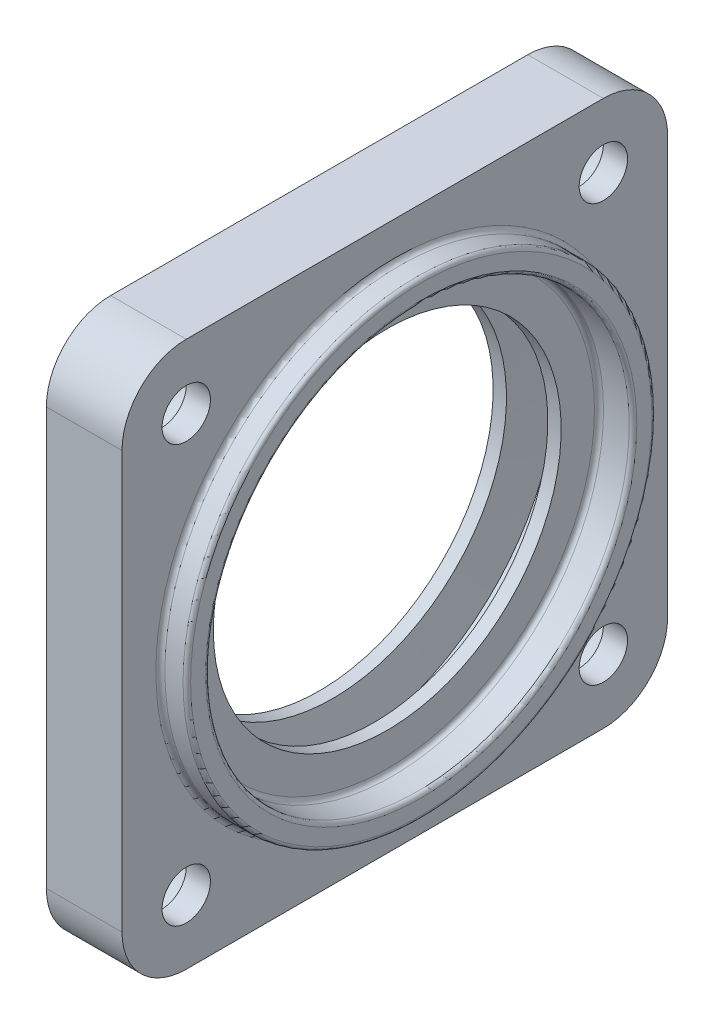
ISO-10303-21;
HEADER;
FILE_DESCRIPTION(('STEP AP214'),'2;1');
FILE_NAME('part.step','',(''),(''),'','','');
FILE_SCHEMA(('AUTOMOTIVE_DESIGN { 1 0 10303 214 1 1 1 1 }'));
ENDSEC;
DATA;
#1=APPLICATION_CONTEXT('core data for automotive mechanical design processes');
#2=APPLICATION_PROTOCOL_DEFINITION('international standard','automotive_design',2000,#1);
#3=PRODUCT_CONTEXT('',#1,'mechanical');
#4=PRODUCT('Part','Part','',(#3));
#5=PRODUCT_RELATED_PRODUCT_CATEGORY('part','',(#4));
#6=PRODUCT_DEFINITION_FORMATION('','',#4);
#7=PRODUCT_DEFINITION_CONTEXT('part definition',#1,'design');
#8=PRODUCT_DEFINITION('design','',#6,#7);
#9=PRODUCT_DEFINITION_SHAPE('','',#8);
#10=(LENGTH_UNIT() NAMED_UNIT(*) SI_UNIT(.MILLI.,.METRE.));
#11=(NAMED_UNIT(*) PLANE_ANGLE_UNIT() SI_UNIT($,.RADIAN.));
#12=(NAMED_UNIT(*) SI_UNIT($,.STERADIAN.) SOLID_ANGLE_UNIT());
#13=UNCERTAINTY_MEASURE_WITH_UNIT(LENGTH_MEASURE(1.E-05),#10,'distance_accuracy_value','');
#14=(GEOMETRIC_REPRESENTATION_CONTEXT(3) GLOBAL_UNCERTAINTY_ASSIGNED_CONTEXT((#13)) GLOBAL_UNIT_ASSIGNED_CONTEXT((#10,
#11,#12)) REPRESENTATION_CONTEXT('',''));
#15=CARTESIAN_POINT('',(0.,0.,0.));
#16=DIRECTION('',(0.,0.,1.));
#17=DIRECTION('',(1.,0.,0.));
#18=AXIS2_PLACEMENT_3D('',#15,#16,#17);
#19=CARTESIAN_POINT('',(0.,0.,0.));
#20=DIRECTION('',(-1.,0.,0.));
#21=DIRECTION('',(0.,0.,1.));
#22=AXIS2_PLACEMENT_3D('',#19,#20,#21);
#23=CYLINDRICAL_SURFACE('',#22,28.);
#24=CARTESIAN_POINT('',(5.09999999999999,0.,0.));
#25=DIRECTION('',(-1.,0.,0.));
#26=DIRECTION('',(0.,0.,1.));
#27=AXIS2_PLACEMENT_3D('',#24,#25,#26);
#28=CIRCLE('',#27,28.);
#29=CARTESIAN_POINT('',(5.09999999999999,0.,28.0000000000001));
#30=VERTEX_POINT('',#29);
#31=EDGE_CURVE('E45',#30,#30,#28,.T.);
#32=ORIENTED_EDGE('',*,*,#31,.T.);
#33=EDGE_LOOP('',(#32));
#34=FACE_BOUND('',#33,.T.);
#35=CARTESIAN_POINT('',(8.50000000000001,0.,0.));
#36=DIRECTION('',(1.,0.,0.));
#37=DIRECTION('',(0.,0.,-1.));
#38=AXIS2_PLACEMENT_3D('',#35,#36,#37);
#39=CIRCLE('',#38,28.);
#40=CARTESIAN_POINT('',(8.50000000000001,0.,-28.0000000000001));
#41=VERTEX_POINT('',#40);
#42=EDGE_CURVE('E268',#41,#41,#39,.T.);
#43=ORIENTED_EDGE('',*,*,#42,.T.);
#44=EDGE_LOOP('',(#43));
#45=FACE_BOUND('',#44,.T.);
#46=ADVANCED_FACE('F37',(#34,#45),#23,.F.);
#47=CARTESIAN_POINT('',(0.,0.,0.));
#48=DIRECTION('',(-1.,0.,0.));
#49=DIRECTION('',(0.,0.,1.));
#50=AXIS2_PLACEMENT_3D('',#47,#48,#49);
#51=CYLINDRICAL_SURFACE('',#50,31.);
#52=CARTESIAN_POINT('',(8.50000000000001,0.,0.));
#53=DIRECTION('',(1.,0.,0.));
#54=DIRECTION('',(0.,0.,-1.));
#55=AXIS2_PLACEMENT_3D('',#52,#53,#54);
#56=CIRCLE('',#55,31.);
#57=CARTESIAN_POINT('',(8.50000000000001,0.,-31.0000000000002));
#58=VERTEX_POINT('',#57);
#59=EDGE_CURVE('E271',#58,#58,#56,.F.);
#60=ORIENTED_EDGE('',*,*,#59,.T.);
#61=EDGE_LOOP('',(#60));
#62=FACE_BOUND('',#61,.T.);
#63=CARTESIAN_POINT('',(6.09999999999999,0.,0.));
#64=DIRECTION('',(-1.,0.,0.));
#65=DIRECTION('',(0.,0.,1.));
#66=AXIS2_PLACEMENT_3D('',#63,#64,#65);
#67=CIRCLE('',#66,31.);
#68=CARTESIAN_POINT('',(6.09999999999999,0.,31.0000000000002));
#69=VERTEX_POINT('',#68);
#70=EDGE_CURVE('E258',#69,#69,#67,.F.);
#71=ORIENTED_EDGE('',*,*,#70,.T.);
#72=EDGE_LOOP('',(#71));
#73=FACE_BOUND('',#72,.T.);
#74=ADVANCED_FACE('F288',(#62,#73),#51,.T.);
#75=CARTESIAN_POINT('',(-4.5,47.5000000000003,0.));
#76=DIRECTION('',(1.,0.,0.));
#77=DIRECTION('',(0.,0.,-1.));
#78=AXIS2_PLACEMENT_3D('',#75,#76,#77);
#79=PLANE('',#78);
#80=CARTESIAN_POINT('',(-4.5,27.5771644662755,-27.5771644662755));
#81=DIRECTION('',(-1.,0.,0.));
#82=DIRECTION('',(0.,0.,1.));
#83=AXIS2_PLACEMENT_3D('',#80,#81,#82);
#84=CIRCLE('',#83,5.49999999999999);
#85=CARTESIAN_POINT('',(-4.5,27.5771644662755,-22.0771644662755));
#86=VERTEX_POINT('',#85);
#87=EDGE_CURVE('E163',#86,#86,#84,.T.);
#88=ORIENTED_EDGE('',*,*,#87,.F.);
#89=EDGE_LOOP('',(#88));
#90=FACE_BOUND('',#89,.T.);
#91=CARTESIAN_POINT('',(-4.5,27.5771644662755,27.5771644662755));
#92=DIRECTION('',(-1.,0.,0.));
#93=DIRECTION('',(0.,0.,1.));
#94=AXIS2_PLACEMENT_3D('',#91,#92,#93);
#95=CIRCLE('',#94,5.49999999999999);
#96=CARTESIAN_POINT('',(-4.5,27.5771644662755,33.0771644662755));
#97=VERTEX_POINT('',#96);
#98=EDGE_CURVE('E175',#97,#97,#95,.T.);
#99=ORIENTED_EDGE('',*,*,#98,.F.);
#100=EDGE_LOOP('',(#99));
#101=FACE_BOUND('',#100,.T.);
#102=CARTESIAN_POINT('',(-4.5,-27.5771644662755,27.5771644662755));
#103=DIRECTION('',(-1.,0.,0.));
#104=DIRECTION('',(0.,0.,1.));
#105=AXIS2_PLACEMENT_3D('',#102,#103,#104);
#106=CIRCLE('',#105,5.49999999999999);
#107=CARTESIAN_POINT('',(-4.5,-27.5771644662755,33.0771644662755));
#108=VERTEX_POINT('',#107);
#109=EDGE_CURVE('E188',#108,#108,#106,.T.);
#110=ORIENTED_EDGE('',*,*,#109,.F.);
#111=EDGE_LOOP('',(#110));
#112=FACE_BOUND('',#111,.T.);
#113=CARTESIAN_POINT('',(-4.5,-27.5771644662755,-27.5771644662755));
#114=DIRECTION('',(-1.,0.,0.));
#115=DIRECTION('',(0.,0.,1.));
#116=AXIS2_PLACEMENT_3D('',#113,#114,#115);
#117=CIRCLE('',#116,5.49999999999999);
#118=CARTESIAN_POINT('',(-4.5,-27.5771644662755,-22.0771644662755));
#119=VERTEX_POINT('',#118);
#120=EDGE_CURVE('E201',#119,#119,#117,.T.);
#121=ORIENTED_EDGE('',*,*,#120,.F.);
#122=EDGE_LOOP('',(#121));
#123=FACE_BOUND('',#122,.T.);
#124=CARTESIAN_POINT('',(-4.5,0.,0.));
#125=DIRECTION('',(-1.,0.,0.));
#126=DIRECTION('',(0.,0.,1.));
#127=AXIS2_PLACEMENT_3D('',#124,#125,#126);
#128=CIRCLE('',#127,23.);
#129=CARTESIAN_POINT('',(-4.5,0.,23.0000000000001));
#130=VERTEX_POINT('',#129);
#131=EDGE_CURVE('E232',#130,#130,#128,.T.);
#132=ORIENTED_EDGE('',*,*,#131,.F.);
#133=EDGE_LOOP('',(#132));
#134=FACE_BOUND('',#133,.T.);
#135=CARTESIAN_POINT('',(-4.5,27.5771644662755,-27.5771644662755));
#136=DIRECTION('',(-1.,0.,0.));
#137=DIRECTION('',(0.,0.,1.));
#138=AXIS2_PLACEMENT_3D('',#135,#136,#137);
#139=CIRCLE('',#138,8.5);
#140=CARTESIAN_POINT('',(-4.5,36.0771644662755,-27.5771644662755));
#141=VERTEX_POINT('',#140);
#142=CARTESIAN_POINT('',(-4.5,27.5771644662757,-36.0771644662755));
#143=VERTEX_POINT('',#142);
#144=EDGE_CURVE('E443',#141,#143,#139,.T.);
#145=ORIENTED_EDGE('',*,*,#144,.T.);
#146=DIRECTION('',(0.,-1.,0.));
#147=VECTOR('',#146,1.);
#148=CARTESIAN_POINT('',(-4.5,27.5771644662757,-36.0771644662755));
#149=LINE('',#148,#147);
#150=CARTESIAN_POINT('',(-4.5,-27.5771644662755,-36.0771644662755));
#151=VERTEX_POINT('',#150);
#152=EDGE_CURVE('E109',#143,#151,#149,.T.);
#153=ORIENTED_EDGE('',*,*,#152,.T.);
#154=CARTESIAN_POINT('',(-4.5,-27.5771644662755,-27.5771644662755));
#155=DIRECTION('',(-1.,0.,0.));
#156=DIRECTION('',(0.,0.,1.));
#157=AXIS2_PLACEMENT_3D('',#154,#155,#156);
#158=CIRCLE('',#157,8.5);
#159=CARTESIAN_POINT('',(-4.5,-36.0771644662755,-27.5771644662755));
#160=VERTEX_POINT('',#159);
#161=EDGE_CURVE('E52',#151,#160,#158,.T.);
#162=ORIENTED_EDGE('',*,*,#161,.T.);
#163=DIRECTION('',(0.,0.,1.));
#164=VECTOR('',#163,1.);
#165=CARTESIAN_POINT('',(-4.5,-36.0771644662755,-27.5771644662755));
#166=LINE('',#165,#164);
#167=CARTESIAN_POINT('',(-4.5,-36.0771644662755,27.5771644662755));
#168=VERTEX_POINT('',#167);
#169=EDGE_CURVE('E107',#160,#168,#166,.T.);
#170=ORIENTED_EDGE('',*,*,#169,.T.);
#171=CARTESIAN_POINT('',(-4.5,-27.5771644662755,27.5771644662755));
#172=DIRECTION('',(-1.,0.,0.));
#173=DIRECTION('',(0.,0.,1.));
#174=AXIS2_PLACEMENT_3D('',#171,#172,#173);
#175=CIRCLE('',#174,8.5);
#176=CARTESIAN_POINT('',(-4.5,-27.5771644662755,36.0771644662755));
#177=VERTEX_POINT('',#176);
#178=EDGE_CURVE('E125',#168,#177,#175,.T.);
#179=ORIENTED_EDGE('',*,*,#178,.T.);
#180=DIRECTION('',(0.,1.,0.));
#181=VECTOR('',#180,1.);
#182=CARTESIAN_POINT('',(-4.5,-27.5771644662755,36.0771644662755));
#183=LINE('',#182,#181);
#184=CARTESIAN_POINT('',(-4.5,27.5771644662755,36.0771644662755));
#185=VERTEX_POINT('',#184);
#186=EDGE_CURVE('E130',#177,#185,#183,.T.);
#187=ORIENTED_EDGE('',*,*,#186,.T.);
#188=CARTESIAN_POINT('',(-4.5,27.5771644662755,27.5771644662755));
#189=DIRECTION('',(-1.,0.,0.));
#190=DIRECTION('',(0.,0.,1.));
#191=AXIS2_PLACEMENT_3D('',#188,#189,#190);
#192=CIRCLE('',#191,8.5);
#193=CARTESIAN_POINT('',(-4.5,36.0771644662755,27.5771644662755));
#194=VERTEX_POINT('',#193);
#195=EDGE_CURVE('E137',#185,#194,#192,.T.);
#196=ORIENTED_EDGE('',*,*,#195,.T.);
#197=DIRECTION('',(0.,0.,-1.));
#198=VECTOR('',#197,1.);
#199=CARTESIAN_POINT('',(-4.5,36.0771644662755,27.5771644662755));
#200=LINE('',#199,#198);
#201=EDGE_CURVE('E139',#194,#141,#200,.T.);
#202=ORIENTED_EDGE('',*,*,#201,.T.);
#203=EDGE_LOOP('',(#145,#153,#162,#170,#179,#187,#196,#202));
#204=FACE_BOUND('',#203,.T.);
#205=ADVANCED_FACE('F105',(#90,#101,#112,#123,#134,#204),#79,.F.);
#206=CARTESIAN_POINT('',(5.50000000000001,31.0000000000002,0.));
#207=DIRECTION('',(-1.,0.,0.));
#208=DIRECTION('',(0.,0.,1.));
#209=AXIS2_PLACEMENT_3D('',#206,#207,#208);
#210=PLANE('',#209);
#211=CARTESIAN_POINT('',(5.50000000000001,0.,0.));
#212=DIRECTION('',(-1.,0.,0.));
#213=DIRECTION('',(0.,0.,1.));
#214=AXIS2_PLACEMENT_3D('',#211,#212,#213);
#215=CIRCLE('',#214,31.6);
#216=CARTESIAN_POINT('',(5.50000000000001,0.,31.6000000000002));
#217=VERTEX_POINT('',#216);
#218=EDGE_CURVE('E254',#217,#217,#215,.T.);
#219=ORIENTED_EDGE('',*,*,#218,.T.);
#220=EDGE_LOOP('',(#219));
#221=FACE_BOUND('',#220,.T.);
#222=CARTESIAN_POINT('',(5.50000000000001,27.5771644662755,-27.5771644662755));
#223=DIRECTION('',(-1.,0.,0.));
#224=DIRECTION('',(0.,0.,1.));
#225=AXIS2_PLACEMENT_3D('',#222,#223,#224);
#226=CIRCLE('',#225,3.2);
#227=CARTESIAN_POINT('',(5.50000000000001,27.5771644662755,-24.3771644662755));
#228=VERTEX_POINT('',#227);
#229=EDGE_CURVE('E174',#228,#228,#226,.T.);
#230=ORIENTED_EDGE('',*,*,#229,.T.);
#231=EDGE_LOOP('',(#230));
#232=FACE_BOUND('',#231,.T.);
#233=CARTESIAN_POINT('',(5.50000000000001,27.5771644662755,27.5771644662755));
#234=DIRECTION('',(-1.,0.,0.));
#235=DIRECTION('',(0.,0.,1.));
#236=AXIS2_PLACEMENT_3D('',#233,#234,#235);
#237=CIRCLE('',#236,3.2);
#238=CARTESIAN_POINT('',(5.50000000000001,27.5771644662755,30.7771644662755));
#239=VERTEX_POINT('',#238);
#240=EDGE_CURVE('E187',#239,#239,#237,.T.);
#241=ORIENTED_EDGE('',*,*,#240,.T.);
#242=EDGE_LOOP('',(#241));
#243=FACE_BOUND('',#242,.T.);
#244=CARTESIAN_POINT('',(5.50000000000001,-27.5771644662755,27.5771644662755));
#245=DIRECTION('',(-1.,0.,0.));
#246=DIRECTION('',(0.,0.,1.));
#247=AXIS2_PLACEMENT_3D('',#244,#245,#246);
#248=CIRCLE('',#247,3.2);
#249=CARTESIAN_POINT('',(5.50000000000001,-27.5771644662755,30.7771644662755));
#250=VERTEX_POINT('',#249);
#251=EDGE_CURVE('E200',#250,#250,#248,.T.);
#252=ORIENTED_EDGE('',*,*,#251,.T.);
#253=EDGE_LOOP('',(#252));
#254=FACE_BOUND('',#253,.T.);
#255=CARTESIAN_POINT('',(5.50000000000001,-27.5771644662755,-27.5771644662755));
#256=DIRECTION('',(-1.,0.,0.));
#257=DIRECTION('',(0.,0.,1.));
#258=AXIS2_PLACEMENT_3D('',#255,#256,#257);
#259=CIRCLE('',#258,3.2);
#260=CARTESIAN_POINT('',(5.50000000000001,-27.5771644662755,-24.3771644662755));
#261=VERTEX_POINT('',#260);
#262=EDGE_CURVE('E213',#261,#261,#259,.T.);
#263=ORIENTED_EDGE('',*,*,#262,.T.);
#264=EDGE_LOOP('',(#263));
#265=FACE_BOUND('',#264,.T.);
#266=CARTESIAN_POINT('',(5.50000000000001,27.5771644662755,27.5771644662755));
#267=DIRECTION('',(-1.,0.,0.));
#268=DIRECTION('',(0.,0.,1.));
#269=AXIS2_PLACEMENT_3D('',#266,#267,#268);
#270=CIRCLE('',#269,8.5);
#271=CARTESIAN_POINT('',(5.50000000000001,27.5771644662755,36.0771644662755));
#272=VERTEX_POINT('',#271);
#273=CARTESIAN_POINT('',(5.50000000000001,36.0771644662755,27.5771644662755));
#274=VERTEX_POINT('',#273);
#275=EDGE_CURVE('E159',#272,#274,#270,.T.);
#276=ORIENTED_EDGE('',*,*,#275,.F.);
#277=DIRECTION('',(0.,1.,0.));
#278=VECTOR('',#277,1.);
#279=CARTESIAN_POINT('',(5.50000000000001,31.0000000000002,36.0771644662755));
#280=LINE('',#279,#278);
#281=CARTESIAN_POINT('',(5.50000000000001,-27.5771644662755,36.0771644662755));
#282=VERTEX_POINT('',#281);
#283=EDGE_CURVE('E251',#282,#272,#280,.T.);
#284=ORIENTED_EDGE('',*,*,#283,.F.);
#285=CARTESIAN_POINT('',(5.50000000000001,-27.5771644662755,27.5771644662755));
#286=DIRECTION('',(-1.,0.,0.));
#287=DIRECTION('',(0.,0.,1.));
#288=AXIS2_PLACEMENT_3D('',#285,#286,#287);
#289=CIRCLE('',#288,8.5);
#290=CARTESIAN_POINT('',(5.50000000000001,-36.0771644662755,27.5771644662755));
#291=VERTEX_POINT('',#290);
#292=EDGE_CURVE('E157',#291,#282,#289,.T.);
#293=ORIENTED_EDGE('',*,*,#292,.F.);
#294=DIRECTION('',(0.,0.,1.));
#295=VECTOR('',#294,1.);
#296=CARTESIAN_POINT('',(5.50000000000001,-36.0771644662755,0.));
#297=LINE('',#296,#295);
#298=CARTESIAN_POINT('',(5.50000000000001,-36.0771644662755,-27.5771644662755));
#299=VERTEX_POINT('',#298);
#300=EDGE_CURVE('E247',#299,#291,#297,.T.);
#301=ORIENTED_EDGE('',*,*,#300,.F.);
#302=CARTESIAN_POINT('',(5.50000000000001,-27.5771644662755,-27.5771644662755));
#303=DIRECTION('',(-1.,0.,0.));
#304=DIRECTION('',(0.,0.,1.));
#305=AXIS2_PLACEMENT_3D('',#302,#303,#304);
#306=CIRCLE('',#305,8.5);
#307=CARTESIAN_POINT('',(5.50000000000001,-27.5771644662755,-36.0771644662755));
#308=VERTEX_POINT('',#307);
#309=EDGE_CURVE('E115',#308,#299,#306,.T.);
#310=ORIENTED_EDGE('',*,*,#309,.F.);
#311=DIRECTION('',(0.,-1.,0.));
#312=VECTOR('',#311,1.);
#313=CARTESIAN_POINT('',(5.50000000000001,31.0000000000003,-36.0771644662755));
#314=LINE('',#313,#312);
#315=CARTESIAN_POINT('',(5.50000000000001,27.5771644662757,-36.0771644662755));
#316=VERTEX_POINT('',#315);
#317=EDGE_CURVE('E236',#316,#308,#314,.T.);
#318=ORIENTED_EDGE('',*,*,#317,.F.);
#319=CARTESIAN_POINT('',(5.50000000000001,27.5771644662755,-27.5771644662755));
#320=DIRECTION('',(-1.,0.,0.));
#321=DIRECTION('',(0.,0.,1.));
#322=AXIS2_PLACEMENT_3D('',#319,#320,#321);
#323=CIRCLE('',#322,8.5);
#324=CARTESIAN_POINT('',(5.50000000000001,36.0771644662755,-27.5771644662755));
#325=VERTEX_POINT('',#324);
#326=EDGE_CURVE('E60',#325,#316,#323,.T.);
#327=ORIENTED_EDGE('',*,*,#326,.F.);
#328=DIRECTION('',(0.,0.,-1.));
#329=VECTOR('',#328,1.);
#330=CARTESIAN_POINT('',(5.50000000000001,36.0771644662755,0.));
#331=LINE('',#330,#329);
#332=EDGE_CURVE('E249',#274,#325,#331,.T.);
#333=ORIENTED_EDGE('',*,*,#332,.F.);
#334=EDGE_LOOP('',(#276,#284,#293,#301,#310,#318,#327,#333));
#335=FACE_BOUND('',#334,.T.);
#336=ADVANCED_FACE('F321',(#221,#232,#243,#254,#265,#335),#210,.F.);
#337=CARTESIAN_POINT('',(0.,0.,0.));
#338=DIRECTION('',(-1.,0.,0.));
#339=DIRECTION('',(0.,0.,1.));
#340=AXIS2_PLACEMENT_3D('',#337,#338,#339);
#341=CYLINDRICAL_SURFACE('',#340,23.);
#342=CARTESIAN_POINT('',(-2.7367073654174,0.,0.));
#343=DIRECTION('',(-1.,0.,0.));
#344=DIRECTION('',(0.,0.,1.));
#345=AXIS2_PLACEMENT_3D('',#342,#343,#344);
#346=CIRCLE('',#345,23.);
#347=CARTESIAN_POINT('',(-2.7367073654174,0.,23.0000000000001));
#348=VERTEX_POINT('',#347);
#349=EDGE_CURVE('E228',#348,#348,#346,.T.);
#350=ORIENTED_EDGE('',*,*,#349,.F.);
#351=EDGE_LOOP('',(#350));
#352=FACE_BOUND('',#351,.T.);
#353=ORIENTED_EDGE('',*,*,#131,.T.);
#354=EDGE_LOOP('',(#353));
#355=FACE_BOUND('',#354,.T.);
#356=ADVANCED_FACE('F317',(#352,#355),#341,.F.);
#357=CARTESIAN_POINT('',(-2.7367073654174,0.,0.));
#358=DIRECTION('',(1.,0.,0.));
#359=DIRECTION('',(0.,0.,-1.));
#360=AXIS2_PLACEMENT_3D('',#357,#358,#359);
#361=CONICAL_SURFACE('',#360,23.,1.4486232791553);
#362=CARTESIAN_POINT('',(-2.,0.,0.));
#363=DIRECTION('',(-1.,0.,0.));
#364=DIRECTION('',(0.,0.,1.));
#365=AXIS2_PLACEMENT_3D('',#362,#363,#364);
#366=CIRCLE('',#365,29.);
#367=CARTESIAN_POINT('',(-2.,0.,29.0000000000001));
#368=VERTEX_POINT('',#367);
#369=EDGE_CURVE('E224',#368,#368,#366,.T.);
#370=ORIENTED_EDGE('',*,*,#369,.F.);
#371=EDGE_LOOP('',(#370));
#372=FACE_BOUND('',#371,.T.);
#373=ORIENTED_EDGE('',*,*,#349,.T.);
#374=EDGE_LOOP('',(#373));
#375=FACE_BOUND('',#374,.T.);
#376=ADVANCED_FACE('F313',(#372,#375),#361,.F.);
#377=CARTESIAN_POINT('',(0.,0.,0.));
#378=DIRECTION('',(-1.,0.,0.));
#379=DIRECTION('',(0.,0.,1.));
#380=AXIS2_PLACEMENT_3D('',#377,#378,#379);
#381=CYLINDRICAL_SURFACE('',#380,29.);
#382=CARTESIAN_POINT('',(2.,0.,0.));
#383=DIRECTION('',(-1.,0.,0.));
#384=DIRECTION('',(0.,0.,1.));
#385=AXIS2_PLACEMENT_3D('',#382,#383,#384);
#386=CIRCLE('',#385,29.);
#387=CARTESIAN_POINT('',(2.,0.,29.0000000000001));
#388=VERTEX_POINT('',#387);
#389=EDGE_CURVE('E220',#388,#388,#386,.T.);
#390=ORIENTED_EDGE('',*,*,#389,.F.);
#391=EDGE_LOOP('',(#390));
#392=FACE_BOUND('',#391,.T.);
#393=ORIENTED_EDGE('',*,*,#369,.T.);
#394=EDGE_LOOP('',(#393));
#395=FACE_BOUND('',#394,.T.);
#396=ADVANCED_FACE('F309',(#392,#395),#381,.F.);
#397=CARTESIAN_POINT('',(2.,0.,0.));
#398=DIRECTION('',(-1.,0.,0.));
#399=DIRECTION('',(0.,0.,1.));
#400=AXIS2_PLACEMENT_3D('',#397,#398,#399);
#401=CONICAL_SURFACE('',#400,29.,1.4486232791553);
#402=CARTESIAN_POINT('',(2.7367073654174,0.,0.));
#403=DIRECTION('',(-1.,0.,0.));
#404=DIRECTION('',(0.,0.,1.));
#405=AXIS2_PLACEMENT_3D('',#402,#403,#404);
#406=CIRCLE('',#405,23.);
#407=CARTESIAN_POINT('',(2.7367073654174,0.,23.0000000000001));
#408=VERTEX_POINT('',#407);
#409=EDGE_CURVE('E217',#408,#408,#406,.T.);
#410=ORIENTED_EDGE('',*,*,#409,.F.);
#411=EDGE_LOOP('',(#410));
#412=FACE_BOUND('',#411,.T.);
#413=ORIENTED_EDGE('',*,*,#389,.T.);
#414=EDGE_LOOP('',(#413));
#415=FACE_BOUND('',#414,.T.);
#416=ADVANCED_FACE('F305',(#412,#415),#401,.F.);
#417=CARTESIAN_POINT('',(0.,0.,0.));
#418=DIRECTION('',(-1.,0.,0.));
#419=DIRECTION('',(0.,0.,1.));
#420=AXIS2_PLACEMENT_3D('',#417,#418,#419);
#421=CYLINDRICAL_SURFACE('',#420,23.);
#422=CARTESIAN_POINT('',(4.5,0.,0.));
#423=DIRECTION('',(-1.,0.,0.));
#424=DIRECTION('',(0.,0.,1.));
#425=AXIS2_PLACEMENT_3D('',#422,#423,#424);
#426=CIRCLE('',#425,23.);
#427=CARTESIAN_POINT('',(4.5,0.,23.0000000000001));
#428=VERTEX_POINT('',#427);
#429=EDGE_CURVE('E214',#428,#428,#426,.T.);
#430=ORIENTED_EDGE('',*,*,#429,.F.);
#431=EDGE_LOOP('',(#430));
#432=FACE_BOUND('',#431,.T.);
#433=ORIENTED_EDGE('',*,*,#409,.T.);
#434=EDGE_LOOP('',(#433));
#435=FACE_BOUND('',#434,.T.);
#436=ADVANCED_FACE('F301',(#432,#435),#421,.F.);
#437=CARTESIAN_POINT('',(4.5,23.0000000000002,0.));
#438=DIRECTION('',(-1.,0.,0.));
#439=DIRECTION('',(0.,0.,1.));
#440=AXIS2_PLACEMENT_3D('',#437,#438,#439);
#441=PLANE('',#440);
#442=CARTESIAN_POINT('',(4.5,0.,0.));
#443=DIRECTION('',(-1.,0.,0.));
#444=DIRECTION('',(0.,0.,1.));
#445=AXIS2_PLACEMENT_3D('',#442,#443,#444);
#446=CIRCLE('',#445,27.4);
#447=CARTESIAN_POINT('',(4.5,0.,27.4000000000001));
#448=VERTEX_POINT('',#447);
#449=EDGE_CURVE('E12',#448,#448,#446,.F.);
#450=ORIENTED_EDGE('',*,*,#449,.T.);
#451=EDGE_LOOP('',(#450));
#452=FACE_BOUND('',#451,.T.);
#453=ORIENTED_EDGE('',*,*,#429,.T.);
#454=EDGE_LOOP('',(#453));
#455=FACE_BOUND('',#454,.T.);
#456=ADVANCED_FACE('F297',(#452,#455),#441,.F.);
#457=CARTESIAN_POINT('',(-4.5,-27.5771644662755,-27.5771644662755));
#458=DIRECTION('',(-1.,0.,0.));
#459=DIRECTION('',(0.,0.,1.));
#460=AXIS2_PLACEMENT_3D('',#457,#458,#459);
#461=CYLINDRICAL_SURFACE('',#460,3.2);
#462=CARTESIAN_POINT('',(2.3,-27.5771644662755,-27.5771644662755));
#463=DIRECTION('',(-1.,0.,0.));
#464=DIRECTION('',(0.,0.,1.));
#465=AXIS2_PLACEMENT_3D('',#462,#463,#464);
#466=CIRCLE('',#465,3.2);
#467=CARTESIAN_POINT('',(2.3,-27.5771644662755,-24.3771644662755));
#468=VERTEX_POINT('',#467);
#469=EDGE_CURVE('E209',#468,#468,#466,.T.);
#470=ORIENTED_EDGE('',*,*,#469,.T.);
#471=EDGE_LOOP('',(#470));
#472=FACE_BOUND('',#471,.T.);
#473=ORIENTED_EDGE('',*,*,#262,.F.);
#474=EDGE_LOOP('',(#473));
#475=FACE_BOUND('',#474,.T.);
#476=ADVANCED_FACE('F300',(#472,#475),#461,.F.);
#477=CARTESIAN_POINT('',(2.3,-24.3771644662755,-27.5771644662755));
#478=DIRECTION('',(1.,0.,0.));
#479=DIRECTION('',(0.,0.,-1.));
#480=AXIS2_PLACEMENT_3D('',#477,#478,#479);
#481=PLANE('',#480);
#482=ORIENTED_EDGE('',*,*,#469,.F.);
#483=EDGE_LOOP('',(#482));
#484=FACE_BOUND('',#483,.T.);
#485=CARTESIAN_POINT('',(2.3,-27.5771644662755,-27.5771644662755));
#486=DIRECTION('',(-1.,0.,0.));
#487=DIRECTION('',(0.,0.,1.));
#488=AXIS2_PLACEMENT_3D('',#485,#486,#487);
#489=CIRCLE('',#488,5.5);
#490=CARTESIAN_POINT('',(2.3,-27.5771644662755,-22.0771644662755));
#491=VERTEX_POINT('',#490);
#492=EDGE_CURVE('E205',#491,#491,#489,.T.);
#493=ORIENTED_EDGE('',*,*,#492,.T.);
#494=EDGE_LOOP('',(#493));
#495=FACE_BOUND('',#494,.T.);
#496=ADVANCED_FACE('F413',(#484,#495),#481,.F.);
#497=CARTESIAN_POINT('',(-4.5,-27.5771644662755,-27.5771644662755));
#498=DIRECTION('',(-1.,0.,0.));
#499=DIRECTION('',(0.,0.,1.));
#500=AXIS2_PLACEMENT_3D('',#497,#498,#499);
#501=CYLINDRICAL_SURFACE('',#500,5.5);
#502=ORIENTED_EDGE('',*,*,#492,.F.);
#503=EDGE_LOOP('',(#502));
#504=FACE_BOUND('',#503,.T.);
#505=ORIENTED_EDGE('',*,*,#120,.T.);
#506=EDGE_LOOP('',(#505));
#507=FACE_BOUND('',#506,.T.);
#508=ADVANCED_FACE('F409',(#504,#507),#501,.F.);
#509=CARTESIAN_POINT('',(-4.5,-27.5771644662755,27.5771644662755));
#510=DIRECTION('',(-1.,0.,0.));
#511=DIRECTION('',(0.,0.,1.));
#512=AXIS2_PLACEMENT_3D('',#509,#510,#511);
#513=CYLINDRICAL_SURFACE('',#512,3.2);
#514=CARTESIAN_POINT('',(2.3,-27.5771644662755,27.5771644662755));
#515=DIRECTION('',(-1.,0.,0.));
#516=DIRECTION('',(0.,0.,1.));
#517=AXIS2_PLACEMENT_3D('',#514,#515,#516);
#518=CIRCLE('',#517,3.2);
#519=CARTESIAN_POINT('',(2.3,-27.5771644662755,30.7771644662755));
#520=VERTEX_POINT('',#519);
#521=EDGE_CURVE('E196',#520,#520,#518,.T.);
#522=ORIENTED_EDGE('',*,*,#521,.T.);
#523=EDGE_LOOP('',(#522));
#524=FACE_BOUND('',#523,.T.);
#525=ORIENTED_EDGE('',*,*,#251,.F.);
#526=EDGE_LOOP('',(#525));
#527=FACE_BOUND('',#526,.T.);
#528=ADVANCED_FACE('F405',(#524,#527),#513,.F.);
#529=CARTESIAN_POINT('',(2.3,-24.3771644662755,27.5771644662755));
#530=DIRECTION('',(1.,0.,0.));
#531=DIRECTION('',(0.,0.,-1.));
#532=AXIS2_PLACEMENT_3D('',#529,#530,#531);
#533=PLANE('',#532);
#534=ORIENTED_EDGE('',*,*,#521,.F.);
#535=EDGE_LOOP('',(#534));
#536=FACE_BOUND('',#535,.T.);
#537=CARTESIAN_POINT('',(2.3,-27.5771644662755,27.5771644662755));
#538=DIRECTION('',(-1.,0.,0.));
#539=DIRECTION('',(0.,0.,1.));
#540=AXIS2_PLACEMENT_3D('',#537,#538,#539);
#541=CIRCLE('',#540,5.5);
#542=CARTESIAN_POINT('',(2.3,-27.5771644662755,33.0771644662755));
#543=VERTEX_POINT('',#542);
#544=EDGE_CURVE('E192',#543,#543,#541,.T.);
#545=ORIENTED_EDGE('',*,*,#544,.T.);
#546=EDGE_LOOP('',(#545));
#547=FACE_BOUND('',#546,.T.);
#548=ADVANCED_FACE('F401',(#536,#547),#533,.F.);
#549=CARTESIAN_POINT('',(-4.5,-27.5771644662755,27.5771644662755));
#550=DIRECTION('',(-1.,0.,0.));
#551=DIRECTION('',(0.,0.,1.));
#552=AXIS2_PLACEMENT_3D('',#549,#550,#551);
#553=CYLINDRICAL_SURFACE('',#552,5.5);
#554=ORIENTED_EDGE('',*,*,#544,.F.);
#555=EDGE_LOOP('',(#554));
#556=FACE_BOUND('',#555,.T.);
#557=ORIENTED_EDGE('',*,*,#109,.T.);
#558=EDGE_LOOP('',(#557));
#559=FACE_BOUND('',#558,.T.);
#560=ADVANCED_FACE('F397',(#556,#559),#553,.F.);
#561=CARTESIAN_POINT('',(-4.5,27.5771644662755,27.5771644662755));
#562=DIRECTION('',(-1.,0.,0.));
#563=DIRECTION('',(0.,0.,1.));
#564=AXIS2_PLACEMENT_3D('',#561,#562,#563);
#565=CYLINDRICAL_SURFACE('',#564,3.2);
#566=CARTESIAN_POINT('',(2.3,27.5771644662755,27.5771644662755));
#567=DIRECTION('',(-1.,0.,0.));
#568=DIRECTION('',(0.,0.,1.));
#569=AXIS2_PLACEMENT_3D('',#566,#567,#568);
#570=CIRCLE('',#569,3.2);
#571=CARTESIAN_POINT('',(2.3,27.5771644662755,30.7771644662755));
#572=VERTEX_POINT('',#571);
#573=EDGE_CURVE('E183',#572,#572,#570,.T.);
#574=ORIENTED_EDGE('',*,*,#573,.T.);
#575=EDGE_LOOP('',(#574));
#576=FACE_BOUND('',#575,.T.);
#577=ORIENTED_EDGE('',*,*,#240,.F.);
#578=EDGE_LOOP('',(#577));
#579=FACE_BOUND('',#578,.T.);
#580=ADVANCED_FACE('F393',(#576,#579),#565,.F.);
#581=CARTESIAN_POINT('',(2.3,30.7771644662755,27.5771644662755));
#582=DIRECTION('',(1.,0.,0.));
#583=DIRECTION('',(0.,0.,-1.));
#584=AXIS2_PLACEMENT_3D('',#581,#582,#583);
#585=PLANE('',#584);
#586=ORIENTED_EDGE('',*,*,#573,.F.);
#587=EDGE_LOOP('',(#586));
#588=FACE_BOUND('',#587,.T.);
#589=CARTESIAN_POINT('',(2.3,27.5771644662755,27.5771644662755));
#590=DIRECTION('',(-1.,0.,0.));
#591=DIRECTION('',(0.,0.,1.));
#592=AXIS2_PLACEMENT_3D('',#589,#590,#591);
#593=CIRCLE('',#592,5.5);
#594=CARTESIAN_POINT('',(2.3,27.5771644662755,33.0771644662756));
#595=VERTEX_POINT('',#594);
#596=EDGE_CURVE('E179',#595,#595,#593,.T.);
#597=ORIENTED_EDGE('',*,*,#596,.T.);
#598=EDGE_LOOP('',(#597));
#599=FACE_BOUND('',#598,.T.);
#600=ADVANCED_FACE('F389',(#588,#599),#585,.F.);
#601=CARTESIAN_POINT('',(-4.5,27.5771644662755,27.5771644662755));
#602=DIRECTION('',(-1.,0.,0.));
#603=DIRECTION('',(0.,0.,1.));
#604=AXIS2_PLACEMENT_3D('',#601,#602,#603);
#605=CYLINDRICAL_SURFACE('',#604,5.49999999999999);
#606=ORIENTED_EDGE('',*,*,#596,.F.);
#607=EDGE_LOOP('',(#606));
#608=FACE_BOUND('',#607,.T.);
#609=ORIENTED_EDGE('',*,*,#98,.T.);
#610=EDGE_LOOP('',(#609));
#611=FACE_BOUND('',#610,.T.);
#612=ADVANCED_FACE('F385',(#608,#611),#605,.F.);
#613=CARTESIAN_POINT('',(-4.5,27.5771644662755,-27.5771644662755));
#614=DIRECTION('',(-1.,0.,0.));
#615=DIRECTION('',(0.,0.,1.));
#616=AXIS2_PLACEMENT_3D('',#613,#614,#615);
#617=CYLINDRICAL_SURFACE('',#616,3.2);
#618=CARTESIAN_POINT('',(2.3,27.5771644662755,-27.5771644662755));
#619=DIRECTION('',(-1.,0.,0.));
#620=DIRECTION('',(0.,0.,1.));
#621=AXIS2_PLACEMENT_3D('',#618,#619,#620);
#622=CIRCLE('',#621,3.2);
#623=CARTESIAN_POINT('',(2.3,27.5771644662755,-24.3771644662755));
#624=VERTEX_POINT('',#623);
#625=EDGE_CURVE('E170',#624,#624,#622,.T.);
#626=ORIENTED_EDGE('',*,*,#625,.T.);
#627=EDGE_LOOP('',(#626));
#628=FACE_BOUND('',#627,.T.);
#629=ORIENTED_EDGE('',*,*,#229,.F.);
#630=EDGE_LOOP('',(#629));
#631=FACE_BOUND('',#630,.T.);
#632=ADVANCED_FACE('F381',(#628,#631),#617,.F.);
#633=CARTESIAN_POINT('',(2.3,30.7771644662755,-27.5771644662755));
#634=DIRECTION('',(1.,0.,0.));
#635=DIRECTION('',(0.,0.,-1.));
#636=AXIS2_PLACEMENT_3D('',#633,#634,#635);
#637=PLANE('',#636);
#638=ORIENTED_EDGE('',*,*,#625,.F.);
#639=EDGE_LOOP('',(#638));
#640=FACE_BOUND('',#639,.T.);
#641=CARTESIAN_POINT('',(2.3,27.5771644662755,-27.5771644662755));
#642=DIRECTION('',(-1.,0.,0.));
#643=DIRECTION('',(0.,0.,1.));
#644=AXIS2_PLACEMENT_3D('',#641,#642,#643);
#645=CIRCLE('',#644,5.5);
#646=CARTESIAN_POINT('',(2.3,27.5771644662755,-22.0771644662755));
#647=VERTEX_POINT('',#646);
#648=EDGE_CURVE('E167',#647,#647,#645,.T.);
#649=ORIENTED_EDGE('',*,*,#648,.T.);
#650=EDGE_LOOP('',(#649));
#651=FACE_BOUND('',#650,.T.);
#652=ADVANCED_FACE('F377',(#640,#651),#637,.F.);
#653=CARTESIAN_POINT('',(-4.5,27.5771644662755,-27.5771644662755));
#654=DIRECTION('',(-1.,0.,0.));
#655=DIRECTION('',(0.,0.,1.));
#656=AXIS2_PLACEMENT_3D('',#653,#654,#655);
#657=CYLINDRICAL_SURFACE('',#656,5.49999999999999);
#658=ORIENTED_EDGE('',*,*,#648,.F.);
#659=EDGE_LOOP('',(#658));
#660=FACE_BOUND('',#659,.T.);
#661=ORIENTED_EDGE('',*,*,#87,.T.);
#662=EDGE_LOOP('',(#661));
#663=FACE_BOUND('',#662,.T.);
#664=ADVANCED_FACE('F354',(#660,#663),#657,.F.);
#665=CARTESIAN_POINT('',(10.5,36.0771644662755,27.5771644662755));
#666=DIRECTION('',(0.,1.,0.));
#667=DIRECTION('',(0.,0.,1.));
#668=AXIS2_PLACEMENT_3D('',#665,#666,#667);
#669=PLANE('',#668);
#670=ORIENTED_EDGE('',*,*,#332,.T.);
#671=DIRECTION('',(-1.,0.,0.));
#672=VECTOR('',#671,1.);
#673=CARTESIAN_POINT('',(10.5,36.0771644662755,-27.5771644662755));
#674=LINE('',#673,#672);
#675=EDGE_CURVE('E143',#325,#141,#674,.T.);
#676=ORIENTED_EDGE('',*,*,#675,.T.);
#677=ORIENTED_EDGE('',*,*,#201,.F.);
#678=DIRECTION('',(-1.,0.,0.));
#679=VECTOR('',#678,1.);
#680=CARTESIAN_POINT('',(10.5,36.0771644662755,27.5771644662755));
#681=LINE('',#680,#679);
#682=EDGE_CURVE('E145',#274,#194,#681,.T.);
#683=ORIENTED_EDGE('',*,*,#682,.F.);
#684=EDGE_LOOP('',(#670,#676,#677,#683));
#685=FACE_BOUND('',#684,.T.);
#686=ADVANCED_FACE('F350',(#685),#669,.T.);
#687=CARTESIAN_POINT('',(10.5,-27.5771644662755,36.0771644662755));
#688=DIRECTION('',(0.,0.,1.));
#689=DIRECTION('',(1.,0.,0.));
#690=AXIS2_PLACEMENT_3D('',#687,#688,#689);
#691=PLANE('',#690);
#692=ORIENTED_EDGE('',*,*,#283,.T.);
#693=DIRECTION('',(-1.,0.,0.));
#694=VECTOR('',#693,1.);
#695=CARTESIAN_POINT('',(10.5,27.5771644662755,36.0771644662755));
#696=LINE('',#695,#694);
#697=EDGE_CURVE('E148',#272,#185,#696,.T.);
#698=ORIENTED_EDGE('',*,*,#697,.T.);
#699=ORIENTED_EDGE('',*,*,#186,.F.);
#700=DIRECTION('',(-1.,0.,0.));
#701=VECTOR('',#700,1.);
#702=CARTESIAN_POINT('',(10.5,-27.5771644662755,36.0771644662755));
#703=LINE('',#702,#701);
#704=EDGE_CURVE('E150',#282,#177,#703,.T.);
#705=ORIENTED_EDGE('',*,*,#704,.F.);
#706=EDGE_LOOP('',(#692,#698,#699,#705));
#707=FACE_BOUND('',#706,.T.);
#708=ADVANCED_FACE('F353',(#707),#691,.T.);
#709=CARTESIAN_POINT('',(10.5,-36.0771644662755,-27.5771644662755));
#710=DIRECTION('',(0.,-1.,0.));
#711=DIRECTION('',(0.,0.,-1.));
#712=AXIS2_PLACEMENT_3D('',#709,#710,#711);
#713=PLANE('',#712);
#714=ORIENTED_EDGE('',*,*,#300,.T.);
#715=DIRECTION('',(-1.,0.,0.));
#716=VECTOR('',#715,1.);
#717=CARTESIAN_POINT('',(10.5,-36.0771644662755,27.5771644662755));
#718=LINE('',#717,#716);
#719=EDGE_CURVE('E118',#291,#168,#718,.T.);
#720=ORIENTED_EDGE('',*,*,#719,.T.);
#721=ORIENTED_EDGE('',*,*,#169,.F.);
#722=DIRECTION('',(-1.,0.,0.));
#723=VECTOR('',#722,1.);
#724=CARTESIAN_POINT('',(10.5,-36.0771644662755,-27.5771644662755));
#725=LINE('',#724,#723);
#726=EDGE_CURVE('E112',#299,#160,#725,.T.);
#727=ORIENTED_EDGE('',*,*,#726,.F.);
#728=EDGE_LOOP('',(#714,#720,#721,#727));
#729=FACE_BOUND('',#728,.T.);
#730=ADVANCED_FACE('F121',(#729),#713,.T.);
#731=CARTESIAN_POINT('',(10.5,27.5771644662757,-36.0771644662755));
#732=DIRECTION('',(0.,0.,-1.));
#733=DIRECTION('',(-1.,0.,0.));
#734=AXIS2_PLACEMENT_3D('',#731,#732,#733);
#735=PLANE('',#734);
#736=ORIENTED_EDGE('',*,*,#317,.T.);
#737=DIRECTION('',(-1.,0.,0.));
#738=VECTOR('',#737,1.);
#739=CARTESIAN_POINT('',(10.5,-27.5771644662755,-36.0771644662755));
#740=LINE('',#739,#738);
#741=EDGE_CURVE('E119',#308,#151,#740,.T.);
#742=ORIENTED_EDGE('',*,*,#741,.T.);
#743=ORIENTED_EDGE('',*,*,#152,.F.);
#744=DIRECTION('',(-1.,0.,0.));
#745=VECTOR('',#744,1.);
#746=CARTESIAN_POINT('',(10.5,27.5771644662757,-36.0771644662755));
#747=LINE('',#746,#745);
#748=EDGE_CURVE('E142',#316,#143,#747,.T.);
#749=ORIENTED_EDGE('',*,*,#748,.F.);
#750=EDGE_LOOP('',(#736,#742,#743,#749));
#751=FACE_BOUND('',#750,.T.);
#752=ADVANCED_FACE('F368',(#751),#735,.T.);
#753=CARTESIAN_POINT('',(10.5,27.5771644662755,-27.5771644662755));
#754=DIRECTION('',(-1.,0.,0.));
#755=DIRECTION('',(0.,0.,1.));
#756=AXIS2_PLACEMENT_3D('',#753,#754,#755);
#757=CYLINDRICAL_SURFACE('',#756,8.5);
#758=ORIENTED_EDGE('',*,*,#326,.T.);
#759=ORIENTED_EDGE('',*,*,#748,.T.);
#760=ORIENTED_EDGE('',*,*,#144,.F.);
#761=ORIENTED_EDGE('',*,*,#675,.F.);
#762=EDGE_LOOP('',(#758,#759,#760,#761));
#763=FACE_BOUND('',#762,.T.);
#764=ADVANCED_FACE('F359',(#763),#757,.T.);
#765=CARTESIAN_POINT('',(10.5,27.5771644662755,27.5771644662755));
#766=DIRECTION('',(-1.,0.,0.));
#767=DIRECTION('',(0.,0.,1.));
#768=AXIS2_PLACEMENT_3D('',#765,#766,#767);
#769=CYLINDRICAL_SURFACE('',#768,8.5);
#770=ORIENTED_EDGE('',*,*,#275,.T.);
#771=ORIENTED_EDGE('',*,*,#682,.T.);
#772=ORIENTED_EDGE('',*,*,#195,.F.);
#773=ORIENTED_EDGE('',*,*,#697,.F.);
#774=EDGE_LOOP('',(#770,#771,#772,#773));
#775=FACE_BOUND('',#774,.T.);
#776=ADVANCED_FACE('F356',(#775),#769,.T.);
#777=CARTESIAN_POINT('',(10.5,-27.5771644662755,27.5771644662755));
#778=DIRECTION('',(-1.,0.,0.));
#779=DIRECTION('',(0.,0.,1.));
#780=AXIS2_PLACEMENT_3D('',#777,#778,#779);
#781=CYLINDRICAL_SURFACE('',#780,8.5);
#782=ORIENTED_EDGE('',*,*,#292,.T.);
#783=ORIENTED_EDGE('',*,*,#704,.T.);
#784=ORIENTED_EDGE('',*,*,#178,.F.);
#785=ORIENTED_EDGE('',*,*,#719,.F.);
#786=EDGE_LOOP('',(#782,#783,#784,#785));
#787=FACE_BOUND('',#786,.T.);
#788=ADVANCED_FACE('F347',(#787),#781,.T.);
#789=CARTESIAN_POINT('',(10.5,-27.5771644662755,-27.5771644662755));
#790=DIRECTION('',(-1.,0.,0.));
#791=DIRECTION('',(0.,0.,1.));
#792=AXIS2_PLACEMENT_3D('',#789,#790,#791);
#793=CYLINDRICAL_SURFACE('',#792,8.5);
#794=ORIENTED_EDGE('',*,*,#309,.T.);
#795=ORIENTED_EDGE('',*,*,#726,.T.);
#796=ORIENTED_EDGE('',*,*,#161,.F.);
#797=ORIENTED_EDGE('',*,*,#741,.F.);
#798=EDGE_LOOP('',(#794,#795,#796,#797));
#799=FACE_BOUND('',#798,.T.);
#800=ADVANCED_FACE('F113',(#799),#793,.T.);
#801=CARTESIAN_POINT('',(9.00000000000001,0.,0.));
#802=DIRECTION('',(1.,0.,0.));
#803=DIRECTION('',(0.,0.,-1.));
#804=AXIS2_PLACEMENT_3D('',#801,#802,#803);
#805=PLANE('',#804);
#806=CARTESIAN_POINT('',(9.00000000000001,0.,0.));
#807=DIRECTION('',(1.,0.,0.));
#808=DIRECTION('',(0.,0.,-1.));
#809=AXIS2_PLACEMENT_3D('',#806,#807,#808);
#810=CIRCLE('',#809,28.5);
#811=CARTESIAN_POINT('',(9.00000000000001,0.,-28.5000000000001));
#812=VERTEX_POINT('',#811);
#813=EDGE_CURVE('E265',#812,#812,#810,.F.);
#814=ORIENTED_EDGE('',*,*,#813,.T.);
#815=EDGE_LOOP('',(#814));
#816=FACE_BOUND('',#815,.T.);
#817=CARTESIAN_POINT('',(9.00000000000001,0.,0.));
#818=DIRECTION('',(1.,0.,0.));
#819=DIRECTION('',(0.,0.,-1.));
#820=AXIS2_PLACEMENT_3D('',#817,#818,#819);
#821=CIRCLE('',#820,30.5);
#822=CARTESIAN_POINT('',(9.00000000000001,0.,-30.5000000000002));
#823=VERTEX_POINT('',#822);
#824=EDGE_CURVE('E262',#823,#823,#821,.T.);
#825=ORIENTED_EDGE('',*,*,#824,.T.);
#826=EDGE_LOOP('',(#825));
#827=FACE_BOUND('',#826,.T.);
#828=ADVANCED_FACE('F329',(#816,#827),#805,.T.);
#829=CARTESIAN_POINT('',(6.09999999999999,0.,0.));
#830=DIRECTION('',(-1.,0.,0.));
#831=DIRECTION('',(0.,0.,1.));
#832=AXIS2_PLACEMENT_3D('',#829,#830,#831);
#833=TOROIDAL_SURFACE('',#832,31.6,0.6);
#834=ORIENTED_EDGE('',*,*,#70,.F.);
#835=EDGE_LOOP('',(#834));
#836=FACE_BOUND('',#835,.T.);
#837=ORIENTED_EDGE('',*,*,#218,.F.);
#838=EDGE_LOOP('',(#837));
#839=FACE_BOUND('',#838,.T.);
#840=ADVANCED_FACE('F326',(#836,#839),#833,.F.);
#841=CARTESIAN_POINT('',(8.50000000000001,0.,0.));
#842=DIRECTION('',(1.,0.,0.));
#843=DIRECTION('',(0.,0.,-1.));
#844=AXIS2_PLACEMENT_3D('',#841,#842,#843);
#845=TOROIDAL_SURFACE('',#844,28.5,0.5);
#846=ORIENTED_EDGE('',*,*,#42,.F.);
#847=EDGE_LOOP('',(#846));
#848=FACE_BOUND('',#847,.T.);
#849=ORIENTED_EDGE('',*,*,#813,.F.);
#850=EDGE_LOOP('',(#849));
#851=FACE_BOUND('',#850,.T.);
#852=ADVANCED_FACE('F284',(#848,#851),#845,.T.);
#853=CARTESIAN_POINT('',(8.50000000000001,0.,0.));
#854=DIRECTION('',(1.,0.,0.));
#855=DIRECTION('',(0.,0.,-1.));
#856=AXIS2_PLACEMENT_3D('',#853,#854,#855);
#857=TOROIDAL_SURFACE('',#856,30.5,0.5);
#858=ORIENTED_EDGE('',*,*,#59,.F.);
#859=EDGE_LOOP('',(#858));
#860=FACE_BOUND('',#859,.T.);
#861=ORIENTED_EDGE('',*,*,#824,.F.);
#862=EDGE_LOOP('',(#861));
#863=FACE_BOUND('',#862,.T.);
#864=ADVANCED_FACE('F279',(#860,#863),#857,.T.);
#865=CARTESIAN_POINT('',(5.09999999999999,0.,0.));
#866=DIRECTION('',(-1.,0.,0.));
#867=DIRECTION('',(0.,0.,1.));
#868=AXIS2_PLACEMENT_3D('',#865,#866,#867);
#869=TOROIDAL_SURFACE('',#868,27.4,0.6);
#870=ORIENTED_EDGE('',*,*,#449,.F.);
#871=EDGE_LOOP('',(#870));
#872=FACE_BOUND('',#871,.T.);
#873=ORIENTED_EDGE('',*,*,#31,.F.);
#874=EDGE_LOOP('',(#873));
#875=FACE_BOUND('',#874,.T.);
#876=ADVANCED_FACE('F39',(#872,#875),#869,.F.);
#877=CLOSED_SHELL('',(#46,#74,#205,#336,#356,#376,#396,#416,#436,#456,#476,#496,#508,#528,#548,
#560,#580,#600,#612,#632,#652,#664,#686,#708,#730,#752,#764,#776,#788,#800,#828,#840,#852,#864,#876));
#878=MANIFOLD_SOLID_BREP('B2',#877);
#879=ADVANCED_BREP_SHAPE_REPRESENTATION('',(#18,#878),#14);
#880=SHAPE_DEFINITION_REPRESENTATION(#9,#879);
ENDSEC;
END-ISO-10303-21;
